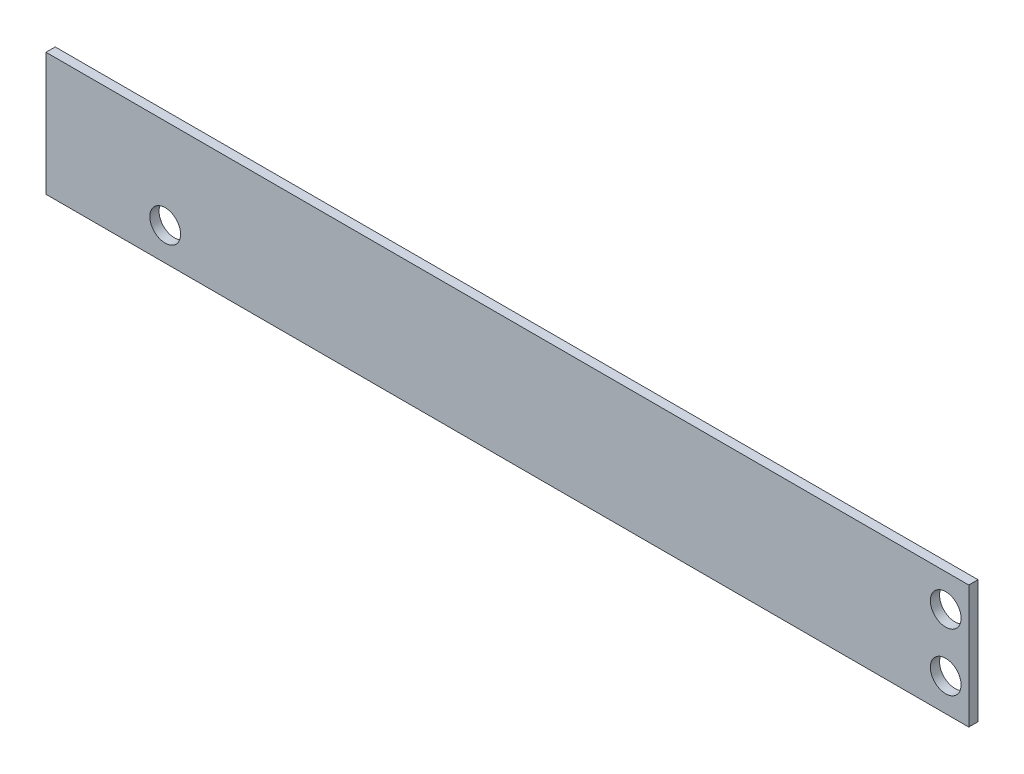
ISO-10303-21;
HEADER;
FILE_DESCRIPTION(('STEP AP214'),'2;1');
FILE_NAME('part.step','',(''),(''),'','','');
FILE_SCHEMA(('AUTOMOTIVE_DESIGN { 1 0 10303 214 1 1 1 1 }'));
ENDSEC;
DATA;
#1=APPLICATION_CONTEXT('core data for automotive mechanical design processes');
#2=APPLICATION_PROTOCOL_DEFINITION('international standard','automotive_design',2000,#1);
#3=PRODUCT_CONTEXT('',#1,'mechanical');
#4=PRODUCT('Part','Part','',(#3));
#5=PRODUCT_RELATED_PRODUCT_CATEGORY('part','',(#4));
#6=PRODUCT_DEFINITION_FORMATION('','',#4);
#7=PRODUCT_DEFINITION_CONTEXT('part definition',#1,'design');
#8=PRODUCT_DEFINITION('design','',#6,#7);
#9=PRODUCT_DEFINITION_SHAPE('','',#8);
#10=(LENGTH_UNIT() NAMED_UNIT(*) SI_UNIT(.MILLI.,.METRE.));
#11=(NAMED_UNIT(*) PLANE_ANGLE_UNIT() SI_UNIT($,.RADIAN.));
#12=(NAMED_UNIT(*) SI_UNIT($,.STERADIAN.) SOLID_ANGLE_UNIT());
#13=UNCERTAINTY_MEASURE_WITH_UNIT(LENGTH_MEASURE(1.E-05),#10,'distance_accuracy_value','');
#14=(GEOMETRIC_REPRESENTATION_CONTEXT(3) GLOBAL_UNCERTAINTY_ASSIGNED_CONTEXT((#13)) GLOBAL_UNIT_ASSIGNED_CONTEXT((#10,
#11,#12)) REPRESENTATION_CONTEXT('',''));
#15=CARTESIAN_POINT('',(0.,0.,0.));
#16=DIRECTION('',(0.,0.,1.));
#17=DIRECTION('',(1.,0.,0.));
#18=AXIS2_PLACEMENT_3D('',#15,#16,#17);
#19=CARTESIAN_POINT('',(0.,0.,0.6));
#20=DIRECTION('',(0.,0.,1.));
#21=DIRECTION('',(1.,0.,0.));
#22=AXIS2_PLACEMENT_3D('',#19,#20,#21);
#23=PLANE('',#22);
#24=CARTESIAN_POINT('',(31.,1.875,0.6));
#25=DIRECTION('',(0.,0.,1.));
#26=DIRECTION('',(1.,0.,0.));
#27=AXIS2_PLACEMENT_3D('',#24,#25,#26);
#28=CIRCLE('',#27,0.999999999999994);
#29=CARTESIAN_POINT('',(32.,1.875,0.6));
#30=VERTEX_POINT('',#29);
#31=EDGE_CURVE('E98',#30,#30,#28,.T.);
#32=ORIENTED_EDGE('',*,*,#31,.F.);
#33=EDGE_LOOP('',(#32));
#34=FACE_BOUND('',#33,.T.);
#35=DIRECTION('',(0.,-1.,0.));
#36=VECTOR('',#35,1.);
#37=CARTESIAN_POINT('',(-27.5,4.,0.6));
#38=LINE('',#37,#36);
#39=CARTESIAN_POINT('',(-27.5,4.,0.6));
#40=VERTEX_POINT('',#39);
#41=CARTESIAN_POINT('',(-27.5,-4.,0.6));
#42=VERTEX_POINT('',#41);
#43=EDGE_CURVE('E68',#40,#42,#38,.T.);
#44=ORIENTED_EDGE('',*,*,#43,.T.);
#45=DIRECTION('',(1.,0.,0.));
#46=VECTOR('',#45,1.);
#47=CARTESIAN_POINT('',(-27.5,-4.,0.6));
#48=LINE('',#47,#46);
#49=CARTESIAN_POINT('',(32.5,-4.,0.6));
#50=VERTEX_POINT('',#49);
#51=EDGE_CURVE('E63',#42,#50,#48,.T.);
#52=ORIENTED_EDGE('',*,*,#51,.T.);
#53=DIRECTION('',(0.,1.,0.));
#54=VECTOR('',#53,1.);
#55=CARTESIAN_POINT('',(32.5,4.,0.6));
#56=LINE('',#55,#54);
#57=CARTESIAN_POINT('',(32.5,4.,0.6));
#58=VERTEX_POINT('',#57);
#59=EDGE_CURVE('E66',#50,#58,#56,.T.);
#60=ORIENTED_EDGE('',*,*,#59,.T.);
#61=DIRECTION('',(-1.,0.,0.));
#62=VECTOR('',#61,1.);
#63=CARTESIAN_POINT('',(-27.5,4.,0.6));
#64=LINE('',#63,#62);
#65=EDGE_CURVE('E33',#58,#40,#64,.T.);
#66=ORIENTED_EDGE('',*,*,#65,.T.);
#67=EDGE_LOOP('',(#44,#52,#60,#66));
#68=FACE_BOUND('',#67,.T.);
#69=CARTESIAN_POINT('',(-19.75,-1.875,0.6));
#70=DIRECTION('',(0.,0.,1.));
#71=DIRECTION('',(1.,0.,0.));
#72=AXIS2_PLACEMENT_3D('',#69,#70,#71);
#73=CIRCLE('',#72,1.);
#74=CARTESIAN_POINT('',(-18.75,-1.875,0.6));
#75=VERTEX_POINT('',#74);
#76=EDGE_CURVE('E83',#75,#75,#73,.T.);
#77=ORIENTED_EDGE('',*,*,#76,.F.);
#78=EDGE_LOOP('',(#77));
#79=FACE_BOUND('',#78,.T.);
#80=CARTESIAN_POINT('',(31.,-1.875,0.6));
#81=DIRECTION('',(0.,0.,1.));
#82=DIRECTION('',(1.,0.,0.));
#83=AXIS2_PLACEMENT_3D('',#80,#81,#82);
#84=CIRCLE('',#83,0.999999999999995);
#85=CARTESIAN_POINT('',(32.,-1.875,0.6));
#86=VERTEX_POINT('',#85);
#87=EDGE_CURVE('E104',#86,#86,#84,.T.);
#88=ORIENTED_EDGE('',*,*,#87,.F.);
#89=EDGE_LOOP('',(#88));
#90=FACE_BOUND('',#89,.T.);
#91=ADVANCED_FACE('F16',(#34,#68,#79,#90),#23,.T.);
#92=CARTESIAN_POINT('',(0.,0.,0.));
#93=DIRECTION('',(0.,0.,1.));
#94=DIRECTION('',(1.,0.,0.));
#95=AXIS2_PLACEMENT_3D('',#92,#93,#94);
#96=PLANE('',#95);
#97=CARTESIAN_POINT('',(31.,1.875,0.));
#98=DIRECTION('',(0.,0.,1.));
#99=DIRECTION('',(1.,0.,0.));
#100=AXIS2_PLACEMENT_3D('',#97,#98,#99);
#101=CIRCLE('',#100,0.999999999999994);
#102=CARTESIAN_POINT('',(32.,1.875,0.));
#103=VERTEX_POINT('',#102);
#104=EDGE_CURVE('E101',#103,#103,#101,.T.);
#105=ORIENTED_EDGE('',*,*,#104,.T.);
#106=EDGE_LOOP('',(#105));
#107=FACE_BOUND('',#106,.T.);
#108=DIRECTION('',(0.,-1.,0.));
#109=VECTOR('',#108,1.);
#110=CARTESIAN_POINT('',(-27.5,4.,0.));
#111=LINE('',#110,#109);
#112=CARTESIAN_POINT('',(-27.5,4.,0.));
#113=VERTEX_POINT('',#112);
#114=CARTESIAN_POINT('',(-27.5,-4.,0.));
#115=VERTEX_POINT('',#114);
#116=EDGE_CURVE('E80',#113,#115,#111,.T.);
#117=ORIENTED_EDGE('',*,*,#116,.F.);
#118=DIRECTION('',(-1.,0.,0.));
#119=VECTOR('',#118,1.);
#120=CARTESIAN_POINT('',(-27.5,4.,0.));
#121=LINE('',#120,#119);
#122=CARTESIAN_POINT('',(32.5,4.,0.));
#123=VERTEX_POINT('',#122);
#124=EDGE_CURVE('E56',#123,#113,#121,.T.);
#125=ORIENTED_EDGE('',*,*,#124,.F.);
#126=DIRECTION('',(0.,1.,0.));
#127=VECTOR('',#126,1.);
#128=CARTESIAN_POINT('',(32.5,4.,0.));
#129=LINE('',#128,#127);
#130=CARTESIAN_POINT('',(32.5,-4.,0.));
#131=VERTEX_POINT('',#130);
#132=EDGE_CURVE('E50',#131,#123,#129,.T.);
#133=ORIENTED_EDGE('',*,*,#132,.F.);
#134=DIRECTION('',(1.,0.,0.));
#135=VECTOR('',#134,1.);
#136=CARTESIAN_POINT('',(-27.5,-4.,0.));
#137=LINE('',#136,#135);
#138=EDGE_CURVE('E72',#115,#131,#137,.T.);
#139=ORIENTED_EDGE('',*,*,#138,.F.);
#140=EDGE_LOOP('',(#117,#125,#133,#139));
#141=FACE_BOUND('',#140,.T.);
#142=CARTESIAN_POINT('',(-19.75,-1.875,0.));
#143=DIRECTION('',(0.,0.,1.));
#144=DIRECTION('',(1.,0.,0.));
#145=AXIS2_PLACEMENT_3D('',#142,#143,#144);
#146=CIRCLE('',#145,1.);
#147=CARTESIAN_POINT('',(-18.75,-1.875,0.));
#148=VERTEX_POINT('',#147);
#149=EDGE_CURVE('E95',#148,#148,#146,.T.);
#150=ORIENTED_EDGE('',*,*,#149,.T.);
#151=EDGE_LOOP('',(#150));
#152=FACE_BOUND('',#151,.T.);
#153=CARTESIAN_POINT('',(31.,-1.875,0.));
#154=DIRECTION('',(0.,0.,1.));
#155=DIRECTION('',(1.,0.,0.));
#156=AXIS2_PLACEMENT_3D('',#153,#154,#155);
#157=CIRCLE('',#156,0.999999999999995);
#158=CARTESIAN_POINT('',(32.,-1.875,0.));
#159=VERTEX_POINT('',#158);
#160=EDGE_CURVE('E107',#159,#159,#157,.T.);
#161=ORIENTED_EDGE('',*,*,#160,.T.);
#162=EDGE_LOOP('',(#161));
#163=FACE_BOUND('',#162,.T.);
#164=ADVANCED_FACE('F91',(#107,#141,#152,#163),#96,.F.);
#165=CARTESIAN_POINT('',(-27.5,4.,0.6));
#166=DIRECTION('',(1.,0.,0.));
#167=DIRECTION('',(0.,0.,-1.));
#168=AXIS2_PLACEMENT_3D('',#165,#166,#167);
#169=PLANE('',#168);
#170=ORIENTED_EDGE('',*,*,#116,.T.);
#171=DIRECTION('',(0.,0.,-1.));
#172=VECTOR('',#171,1.);
#173=CARTESIAN_POINT('',(-27.5,-4.,0.6));
#174=LINE('',#173,#172);
#175=EDGE_CURVE('E11',#42,#115,#174,.T.);
#176=ORIENTED_EDGE('',*,*,#175,.F.);
#177=ORIENTED_EDGE('',*,*,#43,.F.);
#178=DIRECTION('',(0.,0.,-1.));
#179=VECTOR('',#178,1.);
#180=CARTESIAN_POINT('',(-27.5,4.,0.6));
#181=LINE('',#180,#179);
#182=EDGE_CURVE('E76',#40,#113,#181,.T.);
#183=ORIENTED_EDGE('',*,*,#182,.T.);
#184=EDGE_LOOP('',(#170,#176,#177,#183));
#185=FACE_BOUND('',#184,.T.);
#186=ADVANCED_FACE('F18',(#185),#169,.F.);
#187=CARTESIAN_POINT('',(-27.5,-4.,0.6));
#188=DIRECTION('',(0.,1.,0.));
#189=DIRECTION('',(-1.,0.,0.));
#190=AXIS2_PLACEMENT_3D('',#187,#188,#189);
#191=PLANE('',#190);
#192=ORIENTED_EDGE('',*,*,#138,.T.);
#193=DIRECTION('',(0.,0.,-1.));
#194=VECTOR('',#193,1.);
#195=CARTESIAN_POINT('',(32.5,-4.,0.6));
#196=LINE('',#195,#194);
#197=EDGE_CURVE('E25',#50,#131,#196,.T.);
#198=ORIENTED_EDGE('',*,*,#197,.F.);
#199=ORIENTED_EDGE('',*,*,#51,.F.);
#200=ORIENTED_EDGE('',*,*,#175,.T.);
#201=EDGE_LOOP('',(#192,#198,#199,#200));
#202=FACE_BOUND('',#201,.T.);
#203=ADVANCED_FACE('F71',(#202),#191,.F.);
#204=CARTESIAN_POINT('',(32.5,4.,0.6));
#205=DIRECTION('',(-1.,0.,0.));
#206=DIRECTION('',(0.,0.,1.));
#207=AXIS2_PLACEMENT_3D('',#204,#205,#206);
#208=PLANE('',#207);
#209=ORIENTED_EDGE('',*,*,#132,.T.);
#210=DIRECTION('',(0.,0.,-1.));
#211=VECTOR('',#210,1.);
#212=CARTESIAN_POINT('',(32.5,4.,0.6));
#213=LINE('',#212,#211);
#214=EDGE_CURVE('E73',#58,#123,#213,.T.);
#215=ORIENTED_EDGE('',*,*,#214,.F.);
#216=ORIENTED_EDGE('',*,*,#59,.F.);
#217=ORIENTED_EDGE('',*,*,#197,.T.);
#218=EDGE_LOOP('',(#209,#215,#216,#217));
#219=FACE_BOUND('',#218,.T.);
#220=ADVANCED_FACE('F74',(#219),#208,.F.);
#221=CARTESIAN_POINT('',(-27.5,4.,0.6));
#222=DIRECTION('',(0.,-1.,0.));
#223=DIRECTION('',(0.,0.,-1.));
#224=AXIS2_PLACEMENT_3D('',#221,#222,#223);
#225=PLANE('',#224);
#226=ORIENTED_EDGE('',*,*,#124,.T.);
#227=ORIENTED_EDGE('',*,*,#182,.F.);
#228=ORIENTED_EDGE('',*,*,#65,.F.);
#229=ORIENTED_EDGE('',*,*,#214,.T.);
#230=EDGE_LOOP('',(#226,#227,#228,#229));
#231=FACE_BOUND('',#230,.T.);
#232=ADVANCED_FACE('F88',(#231),#225,.F.);
#233=CARTESIAN_POINT('',(-19.75,-1.875,0.6));
#234=DIRECTION('',(0.,0.,-1.));
#235=DIRECTION('',(-1.,0.,0.));
#236=AXIS2_PLACEMENT_3D('',#233,#234,#235);
#237=CYLINDRICAL_SURFACE('',#236,1.);
#238=ORIENTED_EDGE('',*,*,#76,.T.);
#239=EDGE_LOOP('',(#238));
#240=FACE_BOUND('',#239,.T.);
#241=ORIENTED_EDGE('',*,*,#149,.F.);
#242=EDGE_LOOP('',(#241));
#243=FACE_BOUND('',#242,.T.);
#244=ADVANCED_FACE('F127',(#240,#243),#237,.F.);
#245=CARTESIAN_POINT('',(31.,1.875,0.6));
#246=DIRECTION('',(0.,0.,-1.));
#247=DIRECTION('',(-1.,0.,0.));
#248=AXIS2_PLACEMENT_3D('',#245,#246,#247);
#249=CYLINDRICAL_SURFACE('',#248,0.999999999999994);
#250=ORIENTED_EDGE('',*,*,#31,.T.);
#251=EDGE_LOOP('',(#250));
#252=FACE_BOUND('',#251,.T.);
#253=ORIENTED_EDGE('',*,*,#104,.F.);
#254=EDGE_LOOP('',(#253));
#255=FACE_BOUND('',#254,.T.);
#256=ADVANCED_FACE('F211',(#252,#255),#249,.F.);
#257=CARTESIAN_POINT('',(31.,-1.875,0.6));
#258=DIRECTION('',(0.,0.,-1.));
#259=DIRECTION('',(-1.,0.,0.));
#260=AXIS2_PLACEMENT_3D('',#257,#258,#259);
#261=CYLINDRICAL_SURFACE('',#260,0.999999999999995);
#262=ORIENTED_EDGE('',*,*,#87,.T.);
#263=EDGE_LOOP('',(#262));
#264=FACE_BOUND('',#263,.T.);
#265=ORIENTED_EDGE('',*,*,#160,.F.);
#266=EDGE_LOOP('',(#265));
#267=FACE_BOUND('',#266,.T.);
#268=ADVANCED_FACE('F113',(#264,#267),#261,.F.);
#269=CLOSED_SHELL('',(#91,#164,#186,#203,#220,#232,#244,#256,#268));
#270=MANIFOLD_SOLID_BREP('B1',#269);
#271=ADVANCED_BREP_SHAPE_REPRESENTATION('',(#18,#270),#14);
#272=SHAPE_DEFINITION_REPRESENTATION(#9,#271);
ENDSEC;
END-ISO-10303-21;
